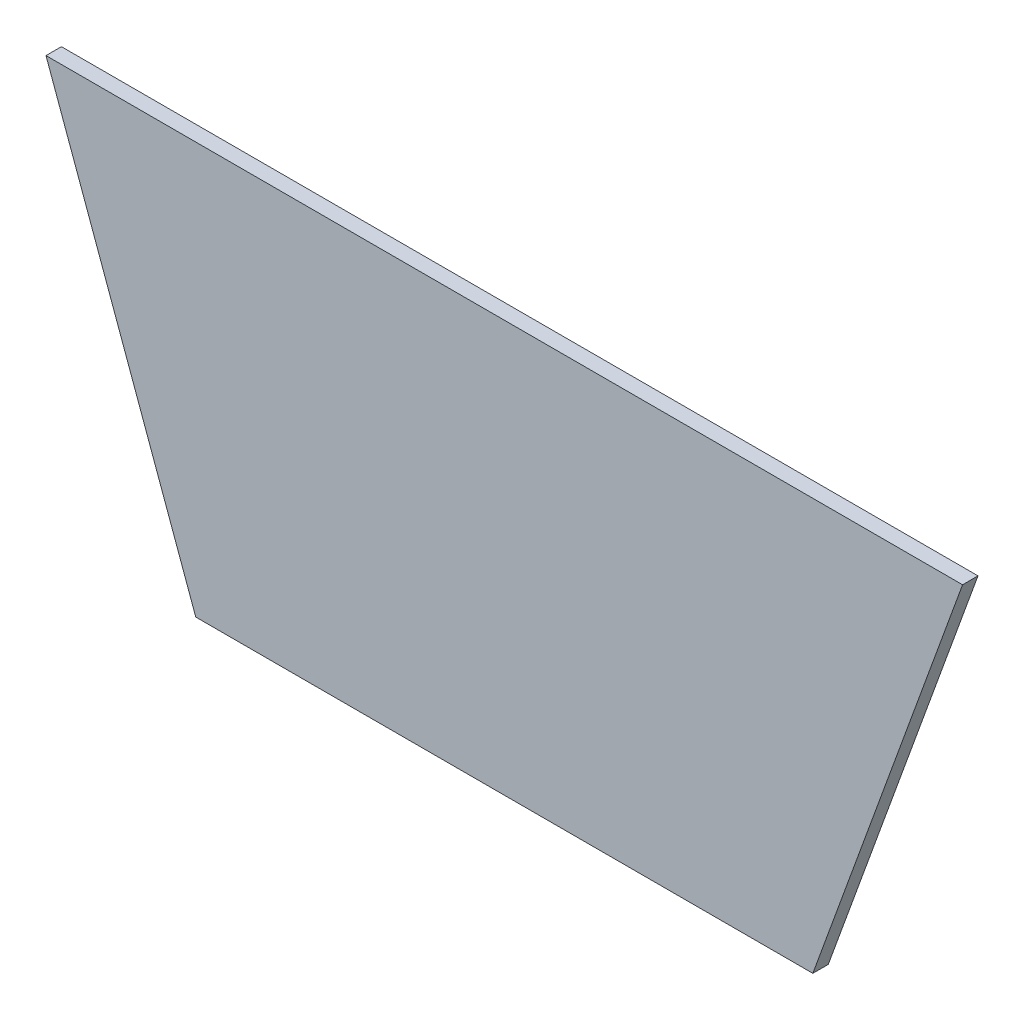
ISO-10303-21;
HEADER;
FILE_DESCRIPTION(('STEP AP214'),'2;1');
FILE_NAME('part.step','',(''),(''),'','','');
FILE_SCHEMA(('AUTOMOTIVE_DESIGN { 1 0 10303 214 1 1 1 1 }'));
ENDSEC;
DATA;
#1=APPLICATION_CONTEXT('core data for automotive mechanical design processes');
#2=APPLICATION_PROTOCOL_DEFINITION('international standard','automotive_design',2000,#1);
#3=PRODUCT_CONTEXT('',#1,'mechanical');
#4=PRODUCT('Part','Part','',(#3));
#5=PRODUCT_RELATED_PRODUCT_CATEGORY('part','',(#4));
#6=PRODUCT_DEFINITION_FORMATION('','',#4);
#7=PRODUCT_DEFINITION_CONTEXT('part definition',#1,'design');
#8=PRODUCT_DEFINITION('design','',#6,#7);
#9=PRODUCT_DEFINITION_SHAPE('','',#8);
#10=(LENGTH_UNIT() NAMED_UNIT(*) SI_UNIT(.MILLI.,.METRE.));
#11=(NAMED_UNIT(*) PLANE_ANGLE_UNIT() SI_UNIT($,.RADIAN.));
#12=(NAMED_UNIT(*) SI_UNIT($,.STERADIAN.) SOLID_ANGLE_UNIT());
#13=UNCERTAINTY_MEASURE_WITH_UNIT(LENGTH_MEASURE(1.E-05),#10,'distance_accuracy_value','');
#14=(GEOMETRIC_REPRESENTATION_CONTEXT(3) GLOBAL_UNCERTAINTY_ASSIGNED_CONTEXT((#13)) GLOBAL_UNIT_ASSIGNED_CONTEXT((#10,
#11,#12)) REPRESENTATION_CONTEXT('',''));
#15=CARTESIAN_POINT('',(0.,0.,0.));
#16=DIRECTION('',(0.,0.,1.));
#17=DIRECTION('',(1.,0.,0.));
#18=AXIS2_PLACEMENT_3D('',#15,#16,#17);
#19=CARTESIAN_POINT('',(-60.,-9.,3.));
#20=DIRECTION('',(0.,1.,0.));
#21=DIRECTION('',(0.,0.,1.));
#22=AXIS2_PLACEMENT_3D('',#19,#20,#21);
#23=PLANE('',#22);
#24=DIRECTION('',(1.,0.,0.));
#25=VECTOR('',#24,1.);
#26=CARTESIAN_POINT('',(-60.,-9.,0.));
#27=LINE('',#26,#25);
#28=CARTESIAN_POINT('',(-60.,-9.,0.));
#29=VERTEX_POINT('',#28);
#30=CARTESIAN_POINT('',(60.,-9.,0.));
#31=VERTEX_POINT('',#30);
#32=EDGE_CURVE('E96',#29,#31,#27,.T.);
#33=ORIENTED_EDGE('',*,*,#32,.T.);
#34=DIRECTION('',(0.,0.,-1.));
#35=VECTOR('',#34,1.);
#36=CARTESIAN_POINT('',(60.,-9.,3.));
#37=LINE('',#36,#35);
#38=CARTESIAN_POINT('',(60.,-9.,3.));
#39=VERTEX_POINT('',#38);
#40=EDGE_CURVE('E11',#39,#31,#37,.T.);
#41=ORIENTED_EDGE('',*,*,#40,.F.);
#42=DIRECTION('',(1.,0.,0.));
#43=VECTOR('',#42,1.);
#44=CARTESIAN_POINT('',(-60.,-9.,3.));
#45=LINE('',#44,#43);
#46=CARTESIAN_POINT('',(-60.,-9.,3.));
#47=VERTEX_POINT('',#46);
#48=EDGE_CURVE('E84',#47,#39,#45,.T.);
#49=ORIENTED_EDGE('',*,*,#48,.F.);
#50=DIRECTION('',(0.,0.,-1.));
#51=VECTOR('',#50,1.);
#52=CARTESIAN_POINT('',(-60.,-9.,3.));
#53=LINE('',#52,#51);
#54=EDGE_CURVE('E92',#47,#29,#53,.T.);
#55=ORIENTED_EDGE('',*,*,#54,.T.);
#56=EDGE_LOOP('',(#33,#41,#49,#55));
#57=FACE_BOUND('',#56,.T.);
#58=ADVANCED_FACE('F33',(#57),#23,.F.);
#59=CARTESIAN_POINT('',(60.,-9.,3.));
#60=DIRECTION('',(-0.939692620785907,0.342020143325673,0.));
#61=DIRECTION('',(-0.342020143325673,-0.939692620785907,0.));
#62=AXIS2_PLACEMENT_3D('',#59,#60,#61);
#63=PLANE('',#62);
#64=DIRECTION('',(0.342020143325673,0.939692620785907,0.));
#65=VECTOR('',#64,1.);
#66=CARTESIAN_POINT('',(60.,-9.,0.));
#67=LINE('',#66,#65);
#68=CARTESIAN_POINT('',(89.1176187412966,71.,0.));
#69=VERTEX_POINT('',#68);
#70=EDGE_CURVE('E88',#31,#69,#67,.T.);
#71=ORIENTED_EDGE('',*,*,#70,.T.);
#72=DIRECTION('',(0.,0.,-1.));
#73=VECTOR('',#72,1.);
#74=CARTESIAN_POINT('',(89.1176187412966,71.,3.));
#75=LINE('',#74,#73);
#76=CARTESIAN_POINT('',(89.1176187412966,71.,3.));
#77=VERTEX_POINT('',#76);
#78=EDGE_CURVE('E41',#77,#69,#75,.T.);
#79=ORIENTED_EDGE('',*,*,#78,.F.);
#80=DIRECTION('',(0.342020143325673,0.939692620785907,0.));
#81=VECTOR('',#80,1.);
#82=CARTESIAN_POINT('',(60.,-9.,3.));
#83=LINE('',#82,#81);
#84=EDGE_CURVE('E79',#39,#77,#83,.T.);
#85=ORIENTED_EDGE('',*,*,#84,.F.);
#86=ORIENTED_EDGE('',*,*,#40,.T.);
#87=EDGE_LOOP('',(#71,#79,#85,#86));
#88=FACE_BOUND('',#87,.T.);
#89=ADVANCED_FACE('F87',(#88),#63,.F.);
#90=CARTESIAN_POINT('',(-89.1176187412966,71.,3.));
#91=DIRECTION('',(0.,-1.,0.));
#92=DIRECTION('',(0.,0.,-1.));
#93=AXIS2_PLACEMENT_3D('',#90,#91,#92);
#94=PLANE('',#93);
#95=DIRECTION('',(-1.,0.,0.));
#96=VECTOR('',#95,1.);
#97=CARTESIAN_POINT('',(-89.1176187412966,71.,0.));
#98=LINE('',#97,#96);
#99=CARTESIAN_POINT('',(-89.1176187412966,71.,0.));
#100=VERTEX_POINT('',#99);
#101=EDGE_CURVE('E66',#69,#100,#98,.T.);
#102=ORIENTED_EDGE('',*,*,#101,.T.);
#103=DIRECTION('',(0.,0.,-1.));
#104=VECTOR('',#103,1.);
#105=CARTESIAN_POINT('',(-89.1176187412966,71.,3.));
#106=LINE('',#105,#104);
#107=CARTESIAN_POINT('',(-89.1176187412966,71.,3.));
#108=VERTEX_POINT('',#107);
#109=EDGE_CURVE('E89',#108,#100,#106,.T.);
#110=ORIENTED_EDGE('',*,*,#109,.F.);
#111=DIRECTION('',(-1.,0.,0.));
#112=VECTOR('',#111,1.);
#113=CARTESIAN_POINT('',(-89.1176187412966,71.,3.));
#114=LINE('',#113,#112);
#115=EDGE_CURVE('E82',#77,#108,#114,.T.);
#116=ORIENTED_EDGE('',*,*,#115,.F.);
#117=ORIENTED_EDGE('',*,*,#78,.T.);
#118=EDGE_LOOP('',(#102,#110,#116,#117));
#119=FACE_BOUND('',#118,.T.);
#120=ADVANCED_FACE('F90',(#119),#94,.F.);
#121=CARTESIAN_POINT('',(-60.,-9.,3.));
#122=DIRECTION('',(0.939692620785907,0.342020143325673,0.));
#123=DIRECTION('',(-0.342020143325673,0.939692620785907,0.));
#124=AXIS2_PLACEMENT_3D('',#121,#122,#123);
#125=PLANE('',#124);
#126=DIRECTION('',(0.342020143325673,-0.939692620785907,0.));
#127=VECTOR('',#126,1.);
#128=CARTESIAN_POINT('',(-60.,-9.,0.));
#129=LINE('',#128,#127);
#130=EDGE_CURVE('E72',#100,#29,#129,.T.);
#131=ORIENTED_EDGE('',*,*,#130,.T.);
#132=ORIENTED_EDGE('',*,*,#54,.F.);
#133=DIRECTION('',(0.342020143325673,-0.939692620785907,0.));
#134=VECTOR('',#133,1.);
#135=CARTESIAN_POINT('',(-60.,-9.,3.));
#136=LINE('',#135,#134);
#137=EDGE_CURVE('E49',#108,#47,#136,.T.);
#138=ORIENTED_EDGE('',*,*,#137,.F.);
#139=ORIENTED_EDGE('',*,*,#109,.T.);
#140=EDGE_LOOP('',(#131,#132,#138,#139));
#141=FACE_BOUND('',#140,.T.);
#142=ADVANCED_FACE('F103',(#141),#125,.F.);
#143=CARTESIAN_POINT('',(0.,0.,3.));
#144=DIRECTION('',(0.,0.,1.));
#145=DIRECTION('',(1.,0.,0.));
#146=AXIS2_PLACEMENT_3D('',#143,#144,#145);
#147=PLANE('',#146);
#148=ORIENTED_EDGE('',*,*,#48,.T.);
#149=ORIENTED_EDGE('',*,*,#84,.T.);
#150=ORIENTED_EDGE('',*,*,#115,.T.);
#151=ORIENTED_EDGE('',*,*,#137,.T.);
#152=EDGE_LOOP('',(#148,#149,#150,#151));
#153=FACE_BOUND('',#152,.T.);
#154=ADVANCED_FACE('F80',(#153),#147,.T.);
#155=CARTESIAN_POINT('',(0.,0.,0.));
#156=DIRECTION('',(0.,0.,1.));
#157=DIRECTION('',(1.,0.,0.));
#158=AXIS2_PLACEMENT_3D('',#155,#156,#157);
#159=PLANE('',#158);
#160=ORIENTED_EDGE('',*,*,#32,.F.);
#161=ORIENTED_EDGE('',*,*,#130,.F.);
#162=ORIENTED_EDGE('',*,*,#101,.F.);
#163=ORIENTED_EDGE('',*,*,#70,.F.);
#164=EDGE_LOOP('',(#160,#161,#162,#163));
#165=FACE_BOUND('',#164,.T.);
#166=ADVANCED_FACE('F106',(#165),#159,.F.);
#167=CLOSED_SHELL('',(#58,#89,#120,#142,#154,#166));
#168=MANIFOLD_SOLID_BREP('B2',#167);
#169=ADVANCED_BREP_SHAPE_REPRESENTATION('',(#18,#168),#14);
#170=SHAPE_DEFINITION_REPRESENTATION(#9,#169);
ENDSEC;
END-ISO-10303-21;
